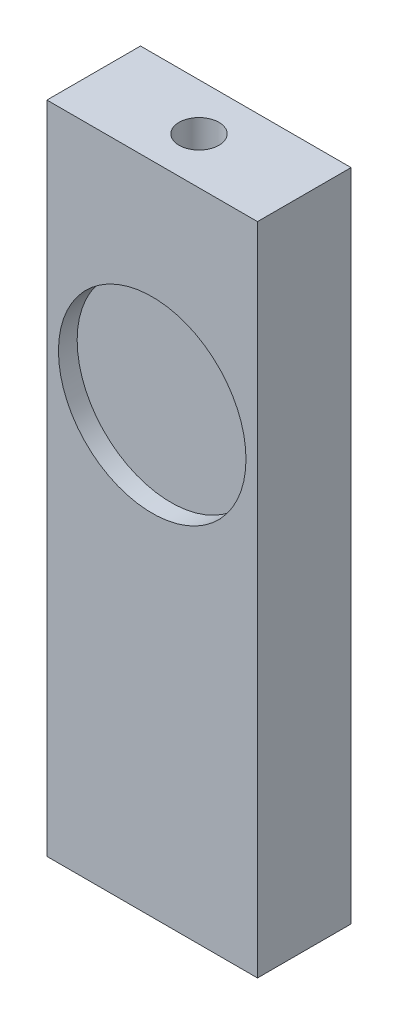
ISO-10303-21;
HEADER;
FILE_DESCRIPTION(('STEP AP214'),'2;1');
FILE_NAME('part.step','',(''),(''),'','','');
FILE_SCHEMA(('AUTOMOTIVE_DESIGN { 1 0 10303 214 1 1 1 1 }'));
ENDSEC;
DATA;
#1=APPLICATION_CONTEXT('core data for automotive mechanical design processes');
#2=APPLICATION_PROTOCOL_DEFINITION('international standard','automotive_design',2000,#1);
#3=PRODUCT_CONTEXT('',#1,'mechanical');
#4=PRODUCT('Part','Part','',(#3));
#5=PRODUCT_RELATED_PRODUCT_CATEGORY('part','',(#4));
#6=PRODUCT_DEFINITION_FORMATION('','',#4);
#7=PRODUCT_DEFINITION_CONTEXT('part definition',#1,'design');
#8=PRODUCT_DEFINITION('design','',#6,#7);
#9=PRODUCT_DEFINITION_SHAPE('','',#8);
#10=(LENGTH_UNIT() NAMED_UNIT(*) SI_UNIT(.MILLI.,.METRE.));
#11=(NAMED_UNIT(*) PLANE_ANGLE_UNIT() SI_UNIT($,.RADIAN.));
#12=(NAMED_UNIT(*) SI_UNIT($,.STERADIAN.) SOLID_ANGLE_UNIT());
#13=UNCERTAINTY_MEASURE_WITH_UNIT(LENGTH_MEASURE(1.E-05),#10,'distance_accuracy_value','');
#14=(GEOMETRIC_REPRESENTATION_CONTEXT(3) GLOBAL_UNCERTAINTY_ASSIGNED_CONTEXT((#13)) GLOBAL_UNIT_ASSIGNED_CONTEXT((#10,
#11,#12)) REPRESENTATION_CONTEXT('',''));
#15=CARTESIAN_POINT('',(0.,0.,0.));
#16=DIRECTION('',(0.,0.,1.));
#17=DIRECTION('',(1.,0.,0.));
#18=AXIS2_PLACEMENT_3D('',#15,#16,#17);
#19=CARTESIAN_POINT('',(-53.1168281653747,44.45,-36.7917312661499));
#20=DIRECTION('',(1.,0.,0.));
#21=DIRECTION('',(0.,0.,-1.));
#22=AXIS2_PLACEMENT_3D('',#19,#20,#21);
#23=PLANE('',#22);
#24=DIRECTION('',(0.,0.,1.));
#25=VECTOR('',#24,1.);
#26=CARTESIAN_POINT('',(-53.1168281653747,0.,-36.7917312661499));
#27=LINE('',#26,#25);
#28=CARTESIAN_POINT('',(-53.1168281653747,0.,-36.7917312661499));
#29=VERTEX_POINT('',#28);
#30=CARTESIAN_POINT('',(-53.1168281653747,0.,-30.4417312661499));
#31=VERTEX_POINT('',#30);
#32=EDGE_CURVE('E114',#29,#31,#27,.T.);
#33=ORIENTED_EDGE('',*,*,#32,.T.);
#34=DIRECTION('',(0.,-1.,0.));
#35=VECTOR('',#34,1.);
#36=CARTESIAN_POINT('',(-53.1168281653747,44.45,-30.4417312661499));
#37=LINE('',#36,#35);
#38=CARTESIAN_POINT('',(-53.1168281653747,44.45,-30.4417312661499));
#39=VERTEX_POINT('',#38);
#40=EDGE_CURVE('E11',#39,#31,#37,.T.);
#41=ORIENTED_EDGE('',*,*,#40,.F.);
#42=DIRECTION('',(0.,0.,1.));
#43=VECTOR('',#42,1.);
#44=CARTESIAN_POINT('',(-53.1168281653747,44.45,-36.7917312661499));
#45=LINE('',#44,#43);
#46=CARTESIAN_POINT('',(-53.1168281653747,44.45,-36.7917312661499));
#47=VERTEX_POINT('',#46);
#48=EDGE_CURVE('E117',#47,#39,#45,.T.);
#49=ORIENTED_EDGE('',*,*,#48,.F.);
#50=DIRECTION('',(0.,-1.,0.));
#51=VECTOR('',#50,1.);
#52=CARTESIAN_POINT('',(-53.1168281653747,44.45,-36.7917312661499));
#53=LINE('',#52,#51);
#54=EDGE_CURVE('E123',#47,#29,#53,.T.);
#55=ORIENTED_EDGE('',*,*,#54,.T.);
#56=EDGE_LOOP('',(#33,#41,#49,#55));
#57=FACE_BOUND('',#56,.T.);
#58=ADVANCED_FACE('F36',(#57),#23,.F.);
#59=CARTESIAN_POINT('',(-53.1168281653747,44.45,-30.4417312661499));
#60=DIRECTION('',(0.,0.,-1.));
#61=DIRECTION('',(-1.,0.,0.));
#62=AXIS2_PLACEMENT_3D('',#59,#60,#61);
#63=PLANE('',#62);
#64=CARTESIAN_POINT('',(-45.9730781653747,30.099,-30.4417312661499));
#65=DIRECTION('',(0.,0.,1.));
#66=DIRECTION('',(1.,0.,0.));
#67=AXIS2_PLACEMENT_3D('',#64,#65,#66);
#68=CIRCLE('',#67,6.3627);
#69=CARTESIAN_POINT('',(-39.6103781653747,30.099,-30.4417312661499));
#70=VERTEX_POINT('',#69);
#71=EDGE_CURVE('E110',#70,#70,#68,.T.);
#72=ORIENTED_EDGE('',*,*,#71,.F.);
#73=EDGE_LOOP('',(#72));
#74=FACE_BOUND('',#73,.T.);
#75=DIRECTION('',(1.,0.,0.));
#76=VECTOR('',#75,1.);
#77=CARTESIAN_POINT('',(-53.1168281653747,0.,-30.4417312661499));
#78=LINE('',#77,#76);
#79=CARTESIAN_POINT('',(-38.8293281653747,0.,-30.4417312661499));
#80=VERTEX_POINT('',#79);
#81=EDGE_CURVE('E126',#31,#80,#78,.T.);
#82=ORIENTED_EDGE('',*,*,#81,.T.);
#83=DIRECTION('',(0.,-1.,0.));
#84=VECTOR('',#83,1.);
#85=CARTESIAN_POINT('',(-38.8293281653747,44.45,-30.4417312661499));
#86=LINE('',#85,#84);
#87=CARTESIAN_POINT('',(-38.8293281653747,44.45,-30.4417312661499));
#88=VERTEX_POINT('',#87);
#89=EDGE_CURVE('E44',#88,#80,#86,.T.);
#90=ORIENTED_EDGE('',*,*,#89,.F.);
#91=DIRECTION('',(1.,0.,0.));
#92=VECTOR('',#91,1.);
#93=CARTESIAN_POINT('',(-53.1168281653747,44.45,-30.4417312661499));
#94=LINE('',#93,#92);
#95=EDGE_CURVE('E83',#39,#88,#94,.T.);
#96=ORIENTED_EDGE('',*,*,#95,.F.);
#97=ORIENTED_EDGE('',*,*,#40,.T.);
#98=EDGE_LOOP('',(#82,#90,#96,#97));
#99=FACE_BOUND('',#98,.T.);
#100=ADVANCED_FACE('F150',(#74,#99),#63,.F.);
#101=CARTESIAN_POINT('',(-38.8293281653747,44.45,-36.7917312661499));
#102=DIRECTION('',(-1.,0.,0.));
#103=DIRECTION('',(0.,0.,1.));
#104=AXIS2_PLACEMENT_3D('',#101,#102,#103);
#105=PLANE('',#104);
#106=DIRECTION('',(0.,0.,-1.));
#107=VECTOR('',#106,1.);
#108=CARTESIAN_POINT('',(-38.8293281653747,0.,-36.7917312661499));
#109=LINE('',#108,#107);
#110=CARTESIAN_POINT('',(-38.8293281653747,0.,-36.7917312661499));
#111=VERTEX_POINT('',#110);
#112=EDGE_CURVE('E70',#80,#111,#109,.T.);
#113=ORIENTED_EDGE('',*,*,#112,.T.);
#114=DIRECTION('',(0.,-1.,0.));
#115=VECTOR('',#114,1.);
#116=CARTESIAN_POINT('',(-38.8293281653747,44.45,-36.7917312661499));
#117=LINE('',#116,#115);
#118=CARTESIAN_POINT('',(-38.8293281653747,44.45,-36.7917312661499));
#119=VERTEX_POINT('',#118);
#120=EDGE_CURVE('E131',#119,#111,#117,.T.);
#121=ORIENTED_EDGE('',*,*,#120,.F.);
#122=DIRECTION('',(0.,0.,-1.));
#123=VECTOR('',#122,1.);
#124=CARTESIAN_POINT('',(-38.8293281653747,44.45,-36.7917312661499));
#125=LINE('',#124,#123);
#126=EDGE_CURVE('E120',#88,#119,#125,.T.);
#127=ORIENTED_EDGE('',*,*,#126,.F.);
#128=ORIENTED_EDGE('',*,*,#89,.T.);
#129=EDGE_LOOP('',(#113,#121,#127,#128));
#130=FACE_BOUND('',#129,.T.);
#131=ADVANCED_FACE('F133',(#130),#105,.F.);
#132=CARTESIAN_POINT('',(-53.1168281653747,44.45,-36.7917312661499));
#133=DIRECTION('',(0.,0.,1.));
#134=DIRECTION('',(1.,0.,0.));
#135=AXIS2_PLACEMENT_3D('',#132,#133,#134);
#136=PLANE('',#135);
#137=DIRECTION('',(-1.,0.,0.));
#138=VECTOR('',#137,1.);
#139=CARTESIAN_POINT('',(-53.1168281653747,0.,-36.7917312661499));
#140=LINE('',#139,#138);
#141=EDGE_CURVE('E76',#111,#29,#140,.T.);
#142=ORIENTED_EDGE('',*,*,#141,.T.);
#143=ORIENTED_EDGE('',*,*,#54,.F.);
#144=DIRECTION('',(-1.,0.,0.));
#145=VECTOR('',#144,1.);
#146=CARTESIAN_POINT('',(-53.1168281653747,44.45,-36.7917312661499));
#147=LINE('',#146,#145);
#148=EDGE_CURVE('E52',#119,#47,#147,.T.);
#149=ORIENTED_EDGE('',*,*,#148,.F.);
#150=ORIENTED_EDGE('',*,*,#120,.T.);
#151=EDGE_LOOP('',(#142,#143,#149,#150));
#152=FACE_BOUND('',#151,.T.);
#153=ADVANCED_FACE('F140',(#152),#136,.F.);
#154=CARTESIAN_POINT('',(-53.1168281653747,44.45,-30.4417312661499));
#155=DIRECTION('',(0.,1.,0.));
#156=DIRECTION('',(0.,0.,1.));
#157=AXIS2_PLACEMENT_3D('',#154,#155,#156);
#158=PLANE('',#157);
#159=CARTESIAN_POINT('',(-45.9730781653747,44.45,-33.6167312661499));
#160=DIRECTION('',(0.,1.,0.));
#161=DIRECTION('',(0.,0.,1.));
#162=AXIS2_PLACEMENT_3D('',#159,#160,#161);
#163=CIRCLE('',#162,1.35254999999999);
#164=CARTESIAN_POINT('',(-45.9730781653747,44.45,-32.2641812661499));
#165=VERTEX_POINT('',#164);
#166=EDGE_CURVE('E99',#165,#165,#163,.T.);
#167=ORIENTED_EDGE('',*,*,#166,.F.);
#168=EDGE_LOOP('',(#167));
#169=FACE_BOUND('',#168,.T.);
#170=ORIENTED_EDGE('',*,*,#48,.T.);
#171=ORIENTED_EDGE('',*,*,#95,.T.);
#172=ORIENTED_EDGE('',*,*,#126,.T.);
#173=ORIENTED_EDGE('',*,*,#148,.T.);
#174=EDGE_LOOP('',(#170,#171,#172,#173));
#175=FACE_BOUND('',#174,.T.);
#176=ADVANCED_FACE('F142',(#169,#175),#158,.T.);
#177=CARTESIAN_POINT('',(-53.1168281653747,0.,-30.4417312661499));
#178=DIRECTION('',(0.,1.,0.));
#179=DIRECTION('',(0.,0.,1.));
#180=AXIS2_PLACEMENT_3D('',#177,#178,#179);
#181=PLANE('',#180);
#182=CARTESIAN_POINT('',(-45.9730781653747,0.,-33.6167312661499));
#183=DIRECTION('',(0.,-1.,0.));
#184=DIRECTION('',(0.,0.,-1.));
#185=AXIS2_PLACEMENT_3D('',#182,#183,#184);
#186=CIRCLE('',#185,1.35254999999999);
#187=CARTESIAN_POINT('',(-45.9730781653747,0.,-34.9692812661499));
#188=VERTEX_POINT('',#187);
#189=EDGE_CURVE('E107',#188,#188,#186,.T.);
#190=ORIENTED_EDGE('',*,*,#189,.F.);
#191=EDGE_LOOP('',(#190));
#192=FACE_BOUND('',#191,.T.);
#193=ORIENTED_EDGE('',*,*,#32,.F.);
#194=ORIENTED_EDGE('',*,*,#141,.F.);
#195=ORIENTED_EDGE('',*,*,#112,.F.);
#196=ORIENTED_EDGE('',*,*,#81,.F.);
#197=EDGE_LOOP('',(#193,#194,#195,#196));
#198=FACE_BOUND('',#197,.T.);
#199=ADVANCED_FACE('F136',(#192,#198),#181,.F.);
#200=CARTESIAN_POINT('',(-45.9730781653747,30.099,-31.7117312661499));
#201=DIRECTION('',(0.,0.,1.));
#202=DIRECTION('',(1.,0.,0.));
#203=AXIS2_PLACEMENT_3D('',#200,#201,#202);
#204=CYLINDRICAL_SURFACE('',#203,6.3627);
#205=CARTESIAN_POINT('',(-45.9730781653747,30.099,-31.7117312661499));
#206=DIRECTION('',(0.,0.,1.));
#207=DIRECTION('',(1.,0.,0.));
#208=AXIS2_PLACEMENT_3D('',#205,#206,#207);
#209=CIRCLE('',#208,6.3627);
#210=CARTESIAN_POINT('',(-39.6103781653747,30.099,-31.7117312661499));
#211=VERTEX_POINT('',#210);
#212=EDGE_CURVE('E111',#211,#211,#209,.T.);
#213=ORIENTED_EDGE('',*,*,#212,.F.);
#214=EDGE_LOOP('',(#213));
#215=FACE_BOUND('',#214,.T.);
#216=ORIENTED_EDGE('',*,*,#71,.T.);
#217=EDGE_LOOP('',(#216));
#218=FACE_BOUND('',#217,.T.);
#219=ADVANCED_FACE('F162',(#215,#218),#204,.F.);
#220=CARTESIAN_POINT('',(-45.9730781653747,30.099,-31.7117312661499));
#221=DIRECTION('',(0.,0.,1.));
#222=DIRECTION('',(1.,0.,0.));
#223=AXIS2_PLACEMENT_3D('',#220,#221,#222);
#224=PLANE('',#223);
#225=ORIENTED_EDGE('',*,*,#212,.T.);
#226=EDGE_LOOP('',(#225));
#227=FACE_BOUND('',#226,.T.);
#228=ADVANCED_FACE('F164',(#227),#224,.T.);
#229=CARTESIAN_POINT('',(-45.9730781653747,0.,-33.6167312661499));
#230=DIRECTION('',(0.,-1.,0.));
#231=DIRECTION('',(0.,0.,-1.));
#232=AXIS2_PLACEMENT_3D('',#229,#230,#231);
#233=CYLINDRICAL_SURFACE('',#232,1.35254999999999);
#234=CARTESIAN_POINT('',(-45.9730781653747,9.398,-33.6167312661499));
#235=DIRECTION('',(0.,-1.,0.));
#236=DIRECTION('',(0.,0.,-1.));
#237=AXIS2_PLACEMENT_3D('',#234,#235,#236);
#238=CIRCLE('',#237,1.35255);
#239=CARTESIAN_POINT('',(-45.9730781653747,9.398,-34.9692812661499));
#240=VERTEX_POINT('',#239);
#241=EDGE_CURVE('E102',#240,#240,#238,.T.);
#242=ORIENTED_EDGE('',*,*,#241,.F.);
#243=EDGE_LOOP('',(#242));
#244=FACE_BOUND('',#243,.T.);
#245=ORIENTED_EDGE('',*,*,#189,.T.);
#246=EDGE_LOOP('',(#245));
#247=FACE_BOUND('',#246,.T.);
#248=ADVANCED_FACE('F171',(#244,#247),#233,.F.);
#249=CARTESIAN_POINT('',(-45.9730781653747,9.398,-33.6167312661499));
#250=DIRECTION('',(0.,-1.,0.));
#251=DIRECTION('',(0.,0.,-1.));
#252=AXIS2_PLACEMENT_3D('',#249,#250,#251);
#253=CONICAL_SURFACE('',#252,1.35255,1.02974425867665);
#254=CARTESIAN_POINT('',(-45.9730781653747,10.2106940302657,-33.6167312661499));
#255=VERTEX_POINT('',#254);
#256=VERTEX_LOOP('',#255);
#257=FACE_BOUND('',#256,.T.);
#258=ORIENTED_EDGE('',*,*,#241,.T.);
#259=EDGE_LOOP('',(#258));
#260=FACE_BOUND('',#259,.T.);
#261=ADVANCED_FACE('F179',(#257,#260),#253,.F.);
#262=CARTESIAN_POINT('',(-45.9730781653747,44.45,-33.6167312661499));
#263=DIRECTION('',(0.,1.,0.));
#264=DIRECTION('',(0.,0.,1.));
#265=AXIS2_PLACEMENT_3D('',#262,#263,#264);
#266=CYLINDRICAL_SURFACE('',#265,1.35254999999999);
#267=CARTESIAN_POINT('',(-45.9730781653747,35.052,-33.6167312661499));
#268=DIRECTION('',(0.,1.,0.));
#269=DIRECTION('',(0.,0.,1.));
#270=AXIS2_PLACEMENT_3D('',#267,#268,#269);
#271=CIRCLE('',#270,1.35255);
#272=CARTESIAN_POINT('',(-45.9730781653747,35.052,-32.2641812661499));
#273=VERTEX_POINT('',#272);
#274=EDGE_CURVE('E97',#273,#273,#271,.T.);
#275=ORIENTED_EDGE('',*,*,#274,.F.);
#276=EDGE_LOOP('',(#275));
#277=FACE_BOUND('',#276,.T.);
#278=ORIENTED_EDGE('',*,*,#166,.T.);
#279=EDGE_LOOP('',(#278));
#280=FACE_BOUND('',#279,.T.);
#281=ADVANCED_FACE('F93',(#277,#280),#266,.F.);
#282=CARTESIAN_POINT('',(-45.9730781653747,35.052,-33.6167312661499));
#283=DIRECTION('',(0.,1.,0.));
#284=DIRECTION('',(0.,0.,1.));
#285=AXIS2_PLACEMENT_3D('',#282,#283,#284);
#286=CONICAL_SURFACE('',#285,1.35255,1.02974425867665);
#287=CARTESIAN_POINT('',(-45.9730781653747,34.2393059697343,-33.6167312661499));
#288=VERTEX_POINT('',#287);
#289=VERTEX_LOOP('',#288);
#290=FACE_BOUND('',#289,.T.);
#291=ORIENTED_EDGE('',*,*,#274,.T.);
#292=EDGE_LOOP('',(#291));
#293=FACE_BOUND('',#292,.T.);
#294=ADVANCED_FACE('F90',(#290,#293),#286,.F.);
#295=CLOSED_SHELL('',(#58,#100,#131,#153,#176,#199,#219,#228,#248,#261,#281,#294));
#296=MANIFOLD_SOLID_BREP('B2',#295);
#297=ADVANCED_BREP_SHAPE_REPRESENTATION('',(#18,#296),#14);
#298=SHAPE_DEFINITION_REPRESENTATION(#9,#297);
ENDSEC;
END-ISO-10303-21;
